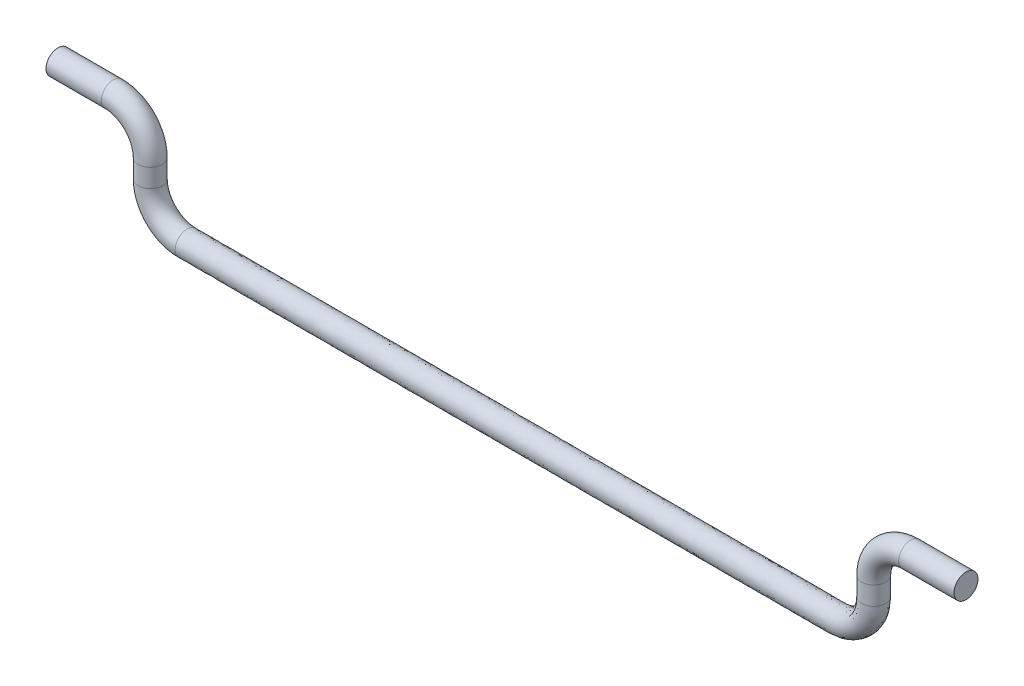
ISO-10303-21;
HEADER;
FILE_DESCRIPTION(('STEP AP214'),'2;1');
FILE_NAME('part.step','',(''),(''),'','','');
FILE_SCHEMA(('AUTOMOTIVE_DESIGN { 1 0 10303 214 1 1 1 1 }'));
ENDSEC;
DATA;
#1=APPLICATION_CONTEXT('core data for automotive mechanical design processes');
#2=APPLICATION_PROTOCOL_DEFINITION('international standard','automotive_design',2000,#1);
#3=PRODUCT_CONTEXT('',#1,'mechanical');
#4=PRODUCT('Part','Part','',(#3));
#5=PRODUCT_RELATED_PRODUCT_CATEGORY('part','',(#4));
#6=PRODUCT_DEFINITION_FORMATION('','',#4);
#7=PRODUCT_DEFINITION_CONTEXT('part definition',#1,'design');
#8=PRODUCT_DEFINITION('design','',#6,#7);
#9=PRODUCT_DEFINITION_SHAPE('','',#8);
#10=(LENGTH_UNIT() NAMED_UNIT(*) SI_UNIT(.MILLI.,.METRE.));
#11=(NAMED_UNIT(*) PLANE_ANGLE_UNIT() SI_UNIT($,.RADIAN.));
#12=(NAMED_UNIT(*) SI_UNIT($,.STERADIAN.) SOLID_ANGLE_UNIT());
#13=UNCERTAINTY_MEASURE_WITH_UNIT(LENGTH_MEASURE(1.E-05),#10,'distance_accuracy_value','');
#14=(GEOMETRIC_REPRESENTATION_CONTEXT(3) GLOBAL_UNCERTAINTY_ASSIGNED_CONTEXT((#13)) GLOBAL_UNIT_ASSIGNED_CONTEXT((#10,
#11,#12)) REPRESENTATION_CONTEXT('',''));
#15=CARTESIAN_POINT('',(0.,0.,0.));
#16=DIRECTION('',(0.,0.,1.));
#17=DIRECTION('',(1.,0.,0.));
#18=AXIS2_PLACEMENT_3D('',#15,#16,#17);
#19=CARTESIAN_POINT('',(42.2,5.,0.));
#20=DIRECTION('',(1.,0.,0.));
#21=DIRECTION('',(0.,0.,-1.));
#22=AXIS2_PLACEMENT_3D('',#19,#20,#21);
#23=PLANE('',#22);
#24=CARTESIAN_POINT('',(42.2,5.,0.));
#25=DIRECTION('',(1.,0.,0.));
#26=DIRECTION('',(0.,0.,-1.));
#27=AXIS2_PLACEMENT_3D('',#24,#25,#26);
#28=CIRCLE('',#27,0.65);
#29=CARTESIAN_POINT('',(42.2,5.,-0.65));
#30=VERTEX_POINT('',#29);
#31=EDGE_CURVE('E78',#30,#30,#28,.T.);
#32=ORIENTED_EDGE('',*,*,#31,.T.);
#33=EDGE_LOOP('',(#32));
#34=FACE_BOUND('',#33,.T.);
#35=ADVANCED_FACE('F39',(#34),#23,.T.);
#36=CARTESIAN_POINT('',(-7.,4.99999999999999,0.));
#37=DIRECTION('',(1.,0.,0.));
#38=DIRECTION('',(0.,0.,-1.));
#39=AXIS2_PLACEMENT_3D('',#36,#37,#38);
#40=PLANE('',#39);
#41=CARTESIAN_POINT('',(-7.,4.99999999999999,0.));
#42=DIRECTION('',(1.,0.,0.));
#43=DIRECTION('',(0.,0.,-1.));
#44=AXIS2_PLACEMENT_3D('',#41,#42,#43);
#45=CIRCLE('',#44,0.65);
#46=CARTESIAN_POINT('',(-7.,4.99999999999999,-0.65));
#47=VERTEX_POINT('',#46);
#48=EDGE_CURVE('E10',#47,#47,#45,.T.);
#49=ORIENTED_EDGE('',*,*,#48,.F.);
#50=EDGE_LOOP('',(#49));
#51=FACE_BOUND('',#50,.T.);
#52=ADVANCED_FACE('F87',(#51),#40,.F.);
#53=CARTESIAN_POINT('',(42.2,5.,0.));
#54=DIRECTION('',(-1.,0.,0.));
#55=DIRECTION('',(0.,0.,1.));
#56=AXIS2_PLACEMENT_3D('',#53,#54,#55);
#57=CYLINDRICAL_SURFACE('',#56,0.65);
#58=CARTESIAN_POINT('',(39.2,5.,0.));
#59=DIRECTION('',(1.,0.,0.));
#60=DIRECTION('',(0.,0.,-1.));
#61=AXIS2_PLACEMENT_3D('',#58,#59,#60);
#62=CIRCLE('',#61,0.65);
#63=CARTESIAN_POINT('',(39.2,5.65,0.));
#64=VERTEX_POINT('',#63);
#65=EDGE_CURVE('E74',#64,#64,#62,.T.);
#66=ORIENTED_EDGE('',*,*,#65,.T.);
#67=EDGE_LOOP('',(#66));
#68=FACE_BOUND('',#67,.T.);
#69=ORIENTED_EDGE('',*,*,#31,.F.);
#70=EDGE_LOOP('',(#69));
#71=FACE_BOUND('',#70,.T.);
#72=ADVANCED_FACE('F84',(#68,#71),#57,.T.);
#73=CARTESIAN_POINT('',(39.2,3.,0.));
#74=DIRECTION('',(0.,0.,1.));
#75=DIRECTION('',(1.,0.,0.));
#76=AXIS2_PLACEMENT_3D('',#73,#74,#75);
#77=TOROIDAL_SURFACE('',#76,2.,0.65);
#78=CARTESIAN_POINT('',(37.2,3.,0.));
#79=DIRECTION('',(0.,1.,0.));
#80=DIRECTION('',(0.,0.,-1.));
#81=AXIS2_PLACEMENT_3D('',#78,#79,#80);
#82=CIRCLE('',#81,0.65);
#83=CARTESIAN_POINT('',(36.55,3.,0.));
#84=VERTEX_POINT('',#83);
#85=EDGE_CURVE('E70',#84,#84,#82,.T.);
#86=CARTESIAN_POINT('',(39.2,3.,0.));
#87=DIRECTION('',(0.,0.,1.));
#88=DIRECTION('',(1.,0.,0.));
#89=AXIS2_PLACEMENT_3D('',#86,#87,#88);
#90=CIRCLE('',#89,2.65);
#91=EDGE_CURVE('',#64,#84,#90,.T.);
#92=ORIENTED_EDGE('',*,*,#65,.F.);
#93=ORIENTED_EDGE('',*,*,#85,.T.);
#94=ORIENTED_EDGE('',*,*,#91,.T.);
#95=ORIENTED_EDGE('',*,*,#91,.F.);
#96=EDGE_LOOP('',(#92,#94,#93,#95));
#97=FACE_BOUND('',#96,.T.);
#98=ADVANCED_FACE('F86',(#97),#77,.T.);
#99=CARTESIAN_POINT('',(37.2,3.,0.));
#100=DIRECTION('',(0.,-1.,0.));
#101=DIRECTION('',(0.,0.,-1.));
#102=AXIS2_PLACEMENT_3D('',#99,#100,#101);
#103=CYLINDRICAL_SURFACE('',#102,0.65);
#104=CARTESIAN_POINT('',(37.2,2.,0.));
#105=DIRECTION('',(0.,1.,0.));
#106=DIRECTION('',(0.,0.,-1.));
#107=AXIS2_PLACEMENT_3D('',#104,#105,#106);
#108=CIRCLE('',#107,0.65);
#109=CARTESIAN_POINT('',(37.2,2.,-0.65));
#110=VERTEX_POINT('',#109);
#111=EDGE_CURVE('E66',#110,#110,#108,.T.);
#112=ORIENTED_EDGE('',*,*,#111,.T.);
#113=EDGE_LOOP('',(#112));
#114=FACE_BOUND('',#113,.T.);
#115=ORIENTED_EDGE('',*,*,#85,.F.);
#116=EDGE_LOOP('',(#115));
#117=FACE_BOUND('',#116,.T.);
#118=ADVANCED_FACE('F94',(#114,#117),#103,.T.);
#119=CARTESIAN_POINT('',(37.2,2.,-0.65));
#120=CARTESIAN_POINT('',(37.2,1.93455015305021,-0.65));
#121=CARTESIAN_POINT('',(37.1967864181831,1.86914747290153,-0.65));
#122=CARTESIAN_POINT('',(37.1839696384264,1.73895813090636,-0.65));
#123=CARTESIAN_POINT('',(37.1743653746865,1.6741721958258,-0.65));
#124=CARTESIAN_POINT('',(37.1360818624047,1.4816211967769,-0.65));
#125=CARTESIAN_POINT('',(37.0978915196712,1.35566358719755,-0.65));
#126=CARTESIAN_POINT('',(36.9474941557254,0.99257223141437,-0.65));
#127=CARTESIAN_POINT('',(36.7993329531879,0.770905828441738,-0.65));
#128=CARTESIAN_POINT('',(36.4290941715583,0.400667046812072,-0.65));
#129=CARTESIAN_POINT('',(36.2074277685884,0.252505844275714,-0.65));
#130=CARTESIAN_POINT('',(35.8443364128011,0.102108480328281,-0.65));
#131=CARTESIAN_POINT('',(35.7183788032222,0.0639181375948269,-0.65));
#132=CARTESIAN_POINT('',(35.5258278041746,0.0256346253137027,-0.65));
#133=CARTESIAN_POINT('',(35.4610418690939,0.0160303615731947,-0.65));
#134=CARTESIAN_POINT('',(35.3308525270982,0.00321358181730516,-0.65));
#135=CARTESIAN_POINT('',(35.2654497176187,8.18116668740894E-06,-0.65));
#136=CARTESIAN_POINT('',(35.1541667572349,-5.72912172166352E-06,-0.65));
#137=CARTESIAN_POINT('',(35.1083333333332,0.,-0.65));
#138=CARTESIAN_POINT('',(35.0166666666668,0.,-0.65));
#139=CARTESIAN_POINT('',(34.9708333333332,0.,-0.65));
#140=CARTESIAN_POINT('',(34.8333333333336,0.,-0.65));
#141=CARTESIAN_POINT('',(34.7416666666664,0.,-0.65));
#142=CARTESIAN_POINT('',(34.4666666666671,0.,-0.65));
#143=CARTESIAN_POINT('',(34.2833333333341,0.,-0.65));
#144=CARTESIAN_POINT('',(33.7333333333317,0.,-0.65));
#145=CARTESIAN_POINT('',(33.366666666667,0.,-0.65));
#146=CARTESIAN_POINT('',(32.266666666666,0.,-0.65));
#147=CARTESIAN_POINT('',(31.5333333333366,0.,-0.65));
#148=CARTESIAN_POINT('',(29.3333333333269,0.,-0.65));
#149=CARTESIAN_POINT('',(27.8666666666629,0.,-0.65));
#150=CARTESIAN_POINT('',(23.4666666666742,0.,-0.65));
#151=CARTESIAN_POINT('',(20.5333333333304,0.,-0.65));
#152=CARTESIAN_POINT('',(14.6666666666696,0.,-0.65));
#153=CARTESIAN_POINT('',(11.7333333333349,0.,-0.65));
#154=CARTESIAN_POINT('',(7.33333333333254,0.,-0.65));
#155=CARTESIAN_POINT('',(5.86666666666745,0.,-0.65));
#156=CARTESIAN_POINT('',(3.66666666666627,0.,-0.65));
#157=CARTESIAN_POINT('',(2.93333333333375,0.,-0.65));
#158=CARTESIAN_POINT('',(1.83333333333316,0.,-0.65));
#159=CARTESIAN_POINT('',(1.46666666666688,0.,-0.65));
#160=CARTESIAN_POINT('',(0.916666666666586,0.,-0.65));
#161=CARTESIAN_POINT('',(0.733333333333413,0.,-0.65));
#162=CARTESIAN_POINT('',(0.458333333333264,0.,-0.65));
#163=CARTESIAN_POINT('',(0.366666666666707,0.,-0.65));
#164=CARTESIAN_POINT('',(0.229166666666633,0.,-0.65));
#165=CARTESIAN_POINT('',(0.183333333333377,0.,-0.65));
#166=CARTESIAN_POINT('',(0.0916666666666621,0.,-0.65));
#167=CARTESIAN_POINT('',(0.045833333333333,0.,-0.65));
#168=CARTESIAN_POINT('',(0.,0.,-0.65));
#169=CARTESIAN_POINT('',(35.9,2.,-0.65));
#170=CARTESIAN_POINT('',(35.9,1.9558213533089,-0.65));
#171=CARTESIAN_POINT('',(35.8988752463644,1.95420161551564,-0.65));
#172=CARTESIAN_POINT('',(35.8943893734489,1.90863534581712,-0.65));
#173=CARTESIAN_POINT('',(35.8910278811404,1.88596026853898,-0.65));
#174=CARTESIAN_POINT('',(35.8776286518413,1.81856741887203,-0.65));
#175=CARTESIAN_POINT('',(35.8642620318848,1.77448225551896,-0.65));
#176=CARTESIAN_POINT('',(35.8116229545042,1.6474002809954,-0.65));
#177=CARTESIAN_POINT('',(35.7597665336162,1.56981703995506,-0.65));
#178=CARTESIAN_POINT('',(35.6301829600449,1.44023346638377,-0.65));
#179=CARTESIAN_POINT('',(35.5525997190055,1.38837704549651,-0.65));
#180=CARTESIAN_POINT('',(35.4255177444806,1.33573796811489,-0.65));
#181=CARTESIAN_POINT('',(35.3814325811275,1.32237134815815,-0.65));
#182=CARTESIAN_POINT('',(35.3140397314612,1.30897211885981,-0.65));
#183=CARTESIAN_POINT('',(35.2913646541829,1.30561062655062,-0.65));
#184=CARTESIAN_POINT('',(35.2457983844844,1.30112475363606,-0.65));
#185=CARTESIAN_POINT('',(35.2441786014252,1.30000286340833,-0.65));
#186=CARTESIAN_POINT('',(35.1690625316989,1.29999799480741,-0.65));
#187=CARTESIAN_POINT('',(35.1083333333332,1.3,-0.65));
#188=CARTESIAN_POINT('',(35.0166666666668,1.3,-0.65));
#189=CARTESIAN_POINT('',(34.9708333333332,1.3,-0.65));
#190=CARTESIAN_POINT('',(34.8333333333336,1.3,-0.65));
#191=CARTESIAN_POINT('',(34.7416666666664,1.3,-0.65));
#192=CARTESIAN_POINT('',(34.4666666666671,1.3,-0.65));
#193=CARTESIAN_POINT('',(34.2833333333341,1.3,-0.65));
#194=CARTESIAN_POINT('',(33.7333333333317,1.3,-0.65));
#195=CARTESIAN_POINT('',(33.366666666667,1.3,-0.65));
#196=CARTESIAN_POINT('',(32.266666666666,1.3,-0.65));
#197=CARTESIAN_POINT('',(31.5333333333366,1.3,-0.65));
#198=CARTESIAN_POINT('',(29.3333333333269,1.3,-0.65));
#199=CARTESIAN_POINT('',(27.8666666666629,1.3,-0.65));
#200=CARTESIAN_POINT('',(23.4666666666742,1.3,-0.65));
#201=CARTESIAN_POINT('',(20.5333333333304,1.3,-0.65));
#202=CARTESIAN_POINT('',(14.6666666666696,1.3,-0.65));
#203=CARTESIAN_POINT('',(11.7333333333349,1.3,-0.65));
#204=CARTESIAN_POINT('',(7.33333333333254,1.3,-0.65));
#205=CARTESIAN_POINT('',(5.86666666666745,1.3,-0.65));
#206=CARTESIAN_POINT('',(3.66666666666627,1.3,-0.65));
#207=CARTESIAN_POINT('',(2.93333333333375,1.3,-0.65));
#208=CARTESIAN_POINT('',(1.83333333333316,1.3,-0.65));
#209=CARTESIAN_POINT('',(1.46666666666688,1.3,-0.65));
#210=CARTESIAN_POINT('',(0.916666666666586,1.3,-0.65));
#211=CARTESIAN_POINT('',(0.733333333333413,1.3,-0.65));
#212=CARTESIAN_POINT('',(0.458333333333264,1.3,-0.65));
#213=CARTESIAN_POINT('',(0.366666666666707,1.3,-0.65));
#214=CARTESIAN_POINT('',(0.229166666666633,1.3,-0.65));
#215=CARTESIAN_POINT('',(0.183333333333377,1.3,-0.65));
#216=CARTESIAN_POINT('',(0.0916666666666621,1.3,-0.65));
#217=CARTESIAN_POINT('',(0.0309374999999998,1.29999999999999,-0.65));
#218=CARTESIAN_POINT('',(0.,1.29999999999999,-0.65));
#219=CARTESIAN_POINT('',(35.9,2.,0.65));
#220=CARTESIAN_POINT('',(35.9,1.9558213533089,0.65));
#221=CARTESIAN_POINT('',(35.8988752463644,1.95420161551564,0.65));
#222=CARTESIAN_POINT('',(35.8943893734489,1.90863534581712,0.65));
#223=CARTESIAN_POINT('',(35.8910278811404,1.88596026853898,0.65));
#224=CARTESIAN_POINT('',(35.8776286518413,1.81856741887203,0.65));
#225=CARTESIAN_POINT('',(35.8642620318848,1.77448225551896,0.65));
#226=CARTESIAN_POINT('',(35.8116229545042,1.6474002809954,0.65));
#227=CARTESIAN_POINT('',(35.7597665336162,1.56981703995506,0.65));
#228=CARTESIAN_POINT('',(35.6301829600449,1.44023346638377,0.65));
#229=CARTESIAN_POINT('',(35.5525997190055,1.38837704549651,0.65));
#230=CARTESIAN_POINT('',(35.4255177444806,1.33573796811489,0.65));
#231=CARTESIAN_POINT('',(35.3814325811275,1.32237134815815,0.65));
#232=CARTESIAN_POINT('',(35.3140397314612,1.30897211885981,0.65));
#233=CARTESIAN_POINT('',(35.2913646541829,1.30561062655062,0.65));
#234=CARTESIAN_POINT('',(35.2457983844844,1.30112475363606,0.65));
#235=CARTESIAN_POINT('',(35.2441786014252,1.30000286340833,0.65));
#236=CARTESIAN_POINT('',(35.1690625316989,1.29999799480741,0.65));
#237=CARTESIAN_POINT('',(35.1083333333332,1.3,0.65));
#238=CARTESIAN_POINT('',(35.0166666666668,1.3,0.65));
#239=CARTESIAN_POINT('',(34.9708333333332,1.3,0.65));
#240=CARTESIAN_POINT('',(34.8333333333336,1.3,0.65));
#241=CARTESIAN_POINT('',(34.7416666666664,1.3,0.65));
#242=CARTESIAN_POINT('',(34.4666666666671,1.3,0.65));
#243=CARTESIAN_POINT('',(34.2833333333341,1.3,0.65));
#244=CARTESIAN_POINT('',(33.7333333333317,1.3,0.65));
#245=CARTESIAN_POINT('',(33.366666666667,1.3,0.65));
#246=CARTESIAN_POINT('',(32.266666666666,1.3,0.65));
#247=CARTESIAN_POINT('',(31.5333333333366,1.3,0.65));
#248=CARTESIAN_POINT('',(29.3333333333269,1.3,0.65));
#249=CARTESIAN_POINT('',(27.8666666666629,1.3,0.65));
#250=CARTESIAN_POINT('',(23.4666666666742,1.3,0.65));
#251=CARTESIAN_POINT('',(20.5333333333304,1.3,0.65));
#252=CARTESIAN_POINT('',(14.6666666666696,1.3,0.65));
#253=CARTESIAN_POINT('',(11.7333333333349,1.3,0.65));
#254=CARTESIAN_POINT('',(7.33333333333254,1.3,0.65));
#255=CARTESIAN_POINT('',(5.86666666666745,1.3,0.65));
#256=CARTESIAN_POINT('',(3.66666666666627,1.3,0.65));
#257=CARTESIAN_POINT('',(2.93333333333375,1.3,0.65));
#258=CARTESIAN_POINT('',(1.83333333333316,1.3,0.65));
#259=CARTESIAN_POINT('',(1.46666666666688,1.3,0.65));
#260=CARTESIAN_POINT('',(0.916666666666586,1.3,0.65));
#261=CARTESIAN_POINT('',(0.733333333333413,1.3,0.65));
#262=CARTESIAN_POINT('',(0.458333333333264,1.3,0.65));
#263=CARTESIAN_POINT('',(0.366666666666707,1.3,0.65));
#264=CARTESIAN_POINT('',(0.229166666666633,1.3,0.65));
#265=CARTESIAN_POINT('',(0.183333333333377,1.3,0.65));
#266=CARTESIAN_POINT('',(0.0916666666666621,1.3,0.65));
#267=CARTESIAN_POINT('',(0.0309374999999998,1.29999999999999,0.65));
#268=CARTESIAN_POINT('',(0.,1.29999999999999,0.65));
#269=CARTESIAN_POINT('',(37.2,2.,0.65));
#270=CARTESIAN_POINT('',(37.2,1.93455015305021,0.65));
#271=CARTESIAN_POINT('',(37.1967864181831,1.86914747290153,0.65));
#272=CARTESIAN_POINT('',(37.1839696384264,1.73895813090636,0.65));
#273=CARTESIAN_POINT('',(37.1743653746865,1.6741721958258,0.65));
#274=CARTESIAN_POINT('',(37.1360818624047,1.4816211967769,0.65));
#275=CARTESIAN_POINT('',(37.0978915196712,1.35566358719755,0.65));
#276=CARTESIAN_POINT('',(36.9474941557254,0.99257223141437,0.65));
#277=CARTESIAN_POINT('',(36.7993329531879,0.770905828441738,0.65));
#278=CARTESIAN_POINT('',(36.4290941715583,0.400667046812072,0.65));
#279=CARTESIAN_POINT('',(36.2074277685884,0.252505844275714,0.65));
#280=CARTESIAN_POINT('',(35.8443364128011,0.102108480328281,0.65));
#281=CARTESIAN_POINT('',(35.7183788032222,0.0639181375948269,0.65));
#282=CARTESIAN_POINT('',(35.5258278041746,0.0256346253137027,0.65));
#283=CARTESIAN_POINT('',(35.4610418690939,0.0160303615731947,0.65));
#284=CARTESIAN_POINT('',(35.3308525270982,0.00321358181730516,0.65));
#285=CARTESIAN_POINT('',(35.2654497176187,8.18116668743372E-06,0.65));
#286=CARTESIAN_POINT('',(35.1541667572349,-5.72912172154553E-06,0.65));
#287=CARTESIAN_POINT('',(35.1083333333332,0.,0.65));
#288=CARTESIAN_POINT('',(35.0166666666668,0.,0.65));
#289=CARTESIAN_POINT('',(34.9708333333332,0.,0.65));
#290=CARTESIAN_POINT('',(34.8333333333336,0.,0.65));
#291=CARTESIAN_POINT('',(34.7416666666664,0.,0.65));
#292=CARTESIAN_POINT('',(34.4666666666671,0.,0.65));
#293=CARTESIAN_POINT('',(34.2833333333341,0.,0.65));
#294=CARTESIAN_POINT('',(33.7333333333317,0.,0.65));
#295=CARTESIAN_POINT('',(33.366666666667,0.,0.65));
#296=CARTESIAN_POINT('',(32.266666666666,0.,0.65));
#297=CARTESIAN_POINT('',(31.5333333333366,0.,0.65));
#298=CARTESIAN_POINT('',(29.3333333333269,0.,0.65));
#299=CARTESIAN_POINT('',(27.8666666666629,0.,0.65));
#300=CARTESIAN_POINT('',(23.4666666666742,0.,0.65));
#301=CARTESIAN_POINT('',(20.5333333333304,0.,0.65));
#302=CARTESIAN_POINT('',(14.6666666666696,0.,0.65));
#303=CARTESIAN_POINT('',(11.7333333333349,0.,0.65));
#304=CARTESIAN_POINT('',(7.33333333333254,0.,0.65));
#305=CARTESIAN_POINT('',(5.86666666666745,0.,0.65));
#306=CARTESIAN_POINT('',(3.66666666666627,0.,0.65));
#307=CARTESIAN_POINT('',(2.93333333333375,0.,0.65));
#308=CARTESIAN_POINT('',(1.83333333333316,0.,0.65));
#309=CARTESIAN_POINT('',(1.46666666666688,0.,0.65));
#310=CARTESIAN_POINT('',(0.916666666666586,0.,0.65));
#311=CARTESIAN_POINT('',(0.733333333333413,0.,0.65));
#312=CARTESIAN_POINT('',(0.458333333333264,0.,0.65));
#313=CARTESIAN_POINT('',(0.366666666666707,0.,0.65));
#314=CARTESIAN_POINT('',(0.229166666666633,0.,0.65));
#315=CARTESIAN_POINT('',(0.183333333333377,0.,0.65));
#316=CARTESIAN_POINT('',(0.0916666666666621,0.,0.65));
#317=CARTESIAN_POINT('',(0.045833333333333,0.,0.65));
#318=CARTESIAN_POINT('',(0.,0.,0.65));
#319=CARTESIAN_POINT('',(38.5,2.,0.65));
#320=CARTESIAN_POINT('',(38.5,1.91327895279153,0.65));
#321=CARTESIAN_POINT('',(38.4946975900017,1.78409333028743,0.65));
#322=CARTESIAN_POINT('',(38.4735499034039,1.5692809159956,0.65));
#323=CARTESIAN_POINT('',(38.4577028682326,1.46238412311262,0.65));
#324=CARTESIAN_POINT('',(38.3945350729681,1.14467497468176,0.65));
#325=CARTESIAN_POINT('',(38.3315210074575,0.936844918876133,0.65));
#326=CARTESIAN_POINT('',(38.0833653569467,0.337744181833343,0.65));
#327=CARTESIAN_POINT('',(37.8388993727596,-0.0280053830715863,0.65));
#328=CARTESIAN_POINT('',(37.2280053830716,-0.638899372759627,0.65));
#329=CARTESIAN_POINT('',(36.8622558181712,-0.883365356945083,0.65));
#330=CARTESIAN_POINT('',(36.2631550811216,-1.13152100745833,0.65));
#331=CARTESIAN_POINT('',(36.0553250253168,-1.1945350729685,0.65));
#332=CARTESIAN_POINT('',(35.737615876888,-1.25770286823241,0.65));
#333=CARTESIAN_POINT('',(35.6307190840049,-1.27354990340423,0.65));
#334=CARTESIAN_POINT('',(35.4159066697121,-1.29469759000144,0.65));
#335=CARTESIAN_POINT('',(35.2867208338122,-1.29998650107495,0.65));
#336=CARTESIAN_POINT('',(35.1392709827708,-1.30000945305085,0.65));
#337=CARTESIAN_POINT('',(35.1083333333332,-1.3,0.65));
#338=CARTESIAN_POINT('',(35.0166666666668,-1.3,0.65));
#339=CARTESIAN_POINT('',(34.9708333333332,-1.3,0.65));
#340=CARTESIAN_POINT('',(34.8333333333336,-1.3,0.65));
#341=CARTESIAN_POINT('',(34.7416666666664,-1.3,0.65));
#342=CARTESIAN_POINT('',(34.4666666666671,-1.3,0.65));
#343=CARTESIAN_POINT('',(34.2833333333341,-1.3,0.65));
#344=CARTESIAN_POINT('',(33.7333333333317,-1.3,0.65));
#345=CARTESIAN_POINT('',(33.366666666667,-1.3,0.65));
#346=CARTESIAN_POINT('',(32.266666666666,-1.3,0.65));
#347=CARTESIAN_POINT('',(31.5333333333366,-1.3,0.65));
#348=CARTESIAN_POINT('',(29.3333333333269,-1.3,0.65));
#349=CARTESIAN_POINT('',(27.8666666666629,-1.3,0.65));
#350=CARTESIAN_POINT('',(23.4666666666742,-1.3,0.65));
#351=CARTESIAN_POINT('',(20.5333333333304,-1.3,0.65));
#352=CARTESIAN_POINT('',(14.6666666666696,-1.3,0.65));
#353=CARTESIAN_POINT('',(11.7333333333349,-1.3,0.65));
#354=CARTESIAN_POINT('',(7.33333333333254,-1.3,0.65));
#355=CARTESIAN_POINT('',(5.86666666666745,-1.3,0.65));
#356=CARTESIAN_POINT('',(3.66666666666627,-1.3,0.65));
#357=CARTESIAN_POINT('',(2.93333333333375,-1.3,0.65));
#358=CARTESIAN_POINT('',(1.83333333333316,-1.3,0.65));
#359=CARTESIAN_POINT('',(1.46666666666688,-1.3,0.65));
#360=CARTESIAN_POINT('',(0.916666666666586,-1.3,0.65));
#361=CARTESIAN_POINT('',(0.733333333333413,-1.3,0.65));
#362=CARTESIAN_POINT('',(0.458333333333264,-1.3,0.65));
#363=CARTESIAN_POINT('',(0.366666666666707,-1.3,0.65));
#364=CARTESIAN_POINT('',(0.229166666666633,-1.3,0.65));
#365=CARTESIAN_POINT('',(0.183333333333377,-1.3,0.65));
#366=CARTESIAN_POINT('',(0.0916666666666621,-1.3,0.65));
#367=CARTESIAN_POINT('',(0.0607291666666662,-1.30000000000001,0.65));
#368=CARTESIAN_POINT('',(0.,-1.30000000000001,0.65));
#369=CARTESIAN_POINT('',(38.5,2.,-0.65));
#370=CARTESIAN_POINT('',(38.5,1.91327895279153,-0.65));
#371=CARTESIAN_POINT('',(38.4946975900017,1.78409333028743,-0.65));
#372=CARTESIAN_POINT('',(38.4735499034039,1.5692809159956,-0.65));
#373=CARTESIAN_POINT('',(38.4577028682326,1.46238412311262,-0.65));
#374=CARTESIAN_POINT('',(38.3945350729681,1.14467497468176,-0.65));
#375=CARTESIAN_POINT('',(38.3315210074575,0.936844918876133,-0.65));
#376=CARTESIAN_POINT('',(38.0833653569467,0.337744181833343,-0.65));
#377=CARTESIAN_POINT('',(37.8388993727596,-0.0280053830715863,-0.65));
#378=CARTESIAN_POINT('',(37.2280053830716,-0.638899372759627,-0.65));
#379=CARTESIAN_POINT('',(36.8622558181712,-0.883365356945083,-0.65));
#380=CARTESIAN_POINT('',(36.2631550811216,-1.13152100745833,-0.65));
#381=CARTESIAN_POINT('',(36.0553250253168,-1.1945350729685,-0.65));
#382=CARTESIAN_POINT('',(35.737615876888,-1.25770286823241,-0.65));
#383=CARTESIAN_POINT('',(35.6307190840049,-1.27354990340423,-0.65));
#384=CARTESIAN_POINT('',(35.4159066697121,-1.29469759000144,-0.65));
#385=CARTESIAN_POINT('',(35.2867208338122,-1.29998650107495,-0.65));
#386=CARTESIAN_POINT('',(35.1392709827708,-1.30000945305085,-0.65));
#387=CARTESIAN_POINT('',(35.1083333333332,-1.3,-0.65));
#388=CARTESIAN_POINT('',(35.0166666666668,-1.3,-0.65));
#389=CARTESIAN_POINT('',(34.9708333333332,-1.3,-0.65));
#390=CARTESIAN_POINT('',(34.8333333333336,-1.3,-0.65));
#391=CARTESIAN_POINT('',(34.7416666666664,-1.3,-0.65));
#392=CARTESIAN_POINT('',(34.4666666666671,-1.3,-0.65));
#393=CARTESIAN_POINT('',(34.2833333333341,-1.3,-0.65));
#394=CARTESIAN_POINT('',(33.7333333333317,-1.3,-0.65));
#395=CARTESIAN_POINT('',(33.366666666667,-1.3,-0.65));
#396=CARTESIAN_POINT('',(32.266666666666,-1.3,-0.65));
#397=CARTESIAN_POINT('',(31.5333333333366,-1.3,-0.65));
#398=CARTESIAN_POINT('',(29.3333333333269,-1.3,-0.65));
#399=CARTESIAN_POINT('',(27.8666666666629,-1.3,-0.65));
#400=CARTESIAN_POINT('',(23.4666666666742,-1.3,-0.65));
#401=CARTESIAN_POINT('',(20.5333333333304,-1.3,-0.65));
#402=CARTESIAN_POINT('',(14.6666666666696,-1.3,-0.65));
#403=CARTESIAN_POINT('',(11.7333333333349,-1.3,-0.65));
#404=CARTESIAN_POINT('',(7.33333333333254,-1.3,-0.65));
#405=CARTESIAN_POINT('',(5.86666666666745,-1.3,-0.65));
#406=CARTESIAN_POINT('',(3.66666666666627,-1.3,-0.65));
#407=CARTESIAN_POINT('',(2.93333333333375,-1.3,-0.65));
#408=CARTESIAN_POINT('',(1.83333333333316,-1.3,-0.65));
#409=CARTESIAN_POINT('',(1.46666666666688,-1.3,-0.65));
#410=CARTESIAN_POINT('',(0.916666666666586,-1.3,-0.65));
#411=CARTESIAN_POINT('',(0.733333333333413,-1.3,-0.65));
#412=CARTESIAN_POINT('',(0.458333333333264,-1.3,-0.65));
#413=CARTESIAN_POINT('',(0.366666666666707,-1.3,-0.65));
#414=CARTESIAN_POINT('',(0.229166666666633,-1.3,-0.65));
#415=CARTESIAN_POINT('',(0.183333333333377,-1.3,-0.65));
#416=CARTESIAN_POINT('',(0.0916666666666621,-1.3,-0.65));
#417=CARTESIAN_POINT('',(0.0607291666666662,-1.30000000000001,-0.65));
#418=CARTESIAN_POINT('',(0.,-1.30000000000001,-0.65));
#419=CARTESIAN_POINT('',(37.2,2.,-0.65));
#420=CARTESIAN_POINT('',(37.2,1.93455015305021,-0.65));
#421=CARTESIAN_POINT('',(37.1967864181831,1.86914747290153,-0.65));
#422=CARTESIAN_POINT('',(37.1839696384264,1.73895813090636,-0.65));
#423=CARTESIAN_POINT('',(37.1743653746865,1.6741721958258,-0.65));
#424=CARTESIAN_POINT('',(37.1360818624047,1.4816211967769,-0.65));
#425=CARTESIAN_POINT('',(37.0978915196712,1.35566358719755,-0.65));
#426=CARTESIAN_POINT('',(36.9474941557254,0.99257223141437,-0.65));
#427=CARTESIAN_POINT('',(36.7993329531879,0.770905828441738,-0.65));
#428=CARTESIAN_POINT('',(36.4290941715583,0.400667046812072,-0.65));
#429=CARTESIAN_POINT('',(36.2074277685884,0.252505844275714,-0.65));
#430=CARTESIAN_POINT('',(35.8443364128011,0.102108480328281,-0.65));
#431=CARTESIAN_POINT('',(35.7183788032222,0.0639181375948269,-0.65));
#432=CARTESIAN_POINT('',(35.5258278041746,0.0256346253137027,-0.65));
#433=CARTESIAN_POINT('',(35.4610418690939,0.0160303615731947,-0.65));
#434=CARTESIAN_POINT('',(35.3308525270982,0.00321358181730516,-0.65));
#435=CARTESIAN_POINT('',(35.2654497176187,8.18116668740894E-06,-0.65));
#436=CARTESIAN_POINT('',(35.1541667572349,-5.72912172166352E-06,-0.65));
#437=CARTESIAN_POINT('',(35.1083333333332,0.,-0.65));
#438=CARTESIAN_POINT('',(35.0166666666668,0.,-0.65));
#439=CARTESIAN_POINT('',(34.9708333333332,0.,-0.65));
#440=CARTESIAN_POINT('',(34.8333333333336,0.,-0.65));
#441=CARTESIAN_POINT('',(34.7416666666664,0.,-0.65));
#442=CARTESIAN_POINT('',(34.4666666666671,0.,-0.65));
#443=CARTESIAN_POINT('',(34.2833333333341,0.,-0.65));
#444=CARTESIAN_POINT('',(33.7333333333317,0.,-0.65));
#445=CARTESIAN_POINT('',(33.366666666667,0.,-0.65));
#446=CARTESIAN_POINT('',(32.266666666666,0.,-0.65));
#447=CARTESIAN_POINT('',(31.5333333333366,0.,-0.65));
#448=CARTESIAN_POINT('',(29.3333333333269,0.,-0.65));
#449=CARTESIAN_POINT('',(27.8666666666629,0.,-0.65));
#450=CARTESIAN_POINT('',(23.4666666666742,0.,-0.65));
#451=CARTESIAN_POINT('',(20.5333333333304,0.,-0.65));
#452=CARTESIAN_POINT('',(14.6666666666696,0.,-0.65));
#453=CARTESIAN_POINT('',(11.7333333333349,0.,-0.65));
#454=CARTESIAN_POINT('',(7.33333333333254,0.,-0.65));
#455=CARTESIAN_POINT('',(5.86666666666745,0.,-0.65));
#456=CARTESIAN_POINT('',(3.66666666666627,0.,-0.65));
#457=CARTESIAN_POINT('',(2.93333333333375,0.,-0.65));
#458=CARTESIAN_POINT('',(1.83333333333316,0.,-0.65));
#459=CARTESIAN_POINT('',(1.46666666666688,0.,-0.65));
#460=CARTESIAN_POINT('',(0.916666666666586,0.,-0.65));
#461=CARTESIAN_POINT('',(0.733333333333413,0.,-0.65));
#462=CARTESIAN_POINT('',(0.458333333333264,0.,-0.65));
#463=CARTESIAN_POINT('',(0.366666666666707,0.,-0.65));
#464=CARTESIAN_POINT('',(0.229166666666633,0.,-0.65));
#465=CARTESIAN_POINT('',(0.183333333333377,0.,-0.65));
#466=CARTESIAN_POINT('',(0.0916666666666621,0.,-0.65));
#467=CARTESIAN_POINT('',(0.045833333333333,0.,-0.65));
#468=CARTESIAN_POINT('',(0.,0.,-0.65));
#469=(BOUNDED_SURFACE() B_SPLINE_SURFACE(3,3,((#119,#120,#121,#122,#123,#124,#125,#126,#127,
#128,#129,#130,#131,#132,#133,#134,#135,#136,#137,#138,#139,#140,#141,#142,#143,#144,#145,#146,
#147,#148,#149,#150,#151,#152,#153,#154,#155,#156,#157,#158,#159,#160,#161,#162,#163,#164,#165,
#166,#167,#168),(#169,#170,#171,#172,#173,#174,#175,#176,#177,#178,#179,#180,#181,#182,#183,
#184,#185,#186,#187,#188,#189,#190,#191,#192,#193,#194,#195,#196,#197,#198,#199,#200,#201,#202,
#203,#204,#205,#206,#207,#208,#209,#210,#211,#212,#213,#214,#215,#216,#217,#218),(#219,#220,
#221,#222,#223,#224,#225,#226,#227,#228,#229,#230,#231,#232,#233,#234,#235,#236,#237,#238,#239,
#240,#241,#242,#243,#244,#245,#246,#247,#248,#249,#250,#251,#252,#253,#254,#255,#256,#257,#258,
#259,#260,#261,#262,#263,#264,#265,#266,#267,#268),(#269,#270,#271,#272,#273,#274,#275,#276,
#277,#278,#279,#280,#281,#282,#283,#284,#285,#286,#287,#288,#289,#290,#291,#292,#293,#294,#295,
#296,#297,#298,#299,#300,#301,#302,#303,#304,#305,#306,#307,#308,#309,#310,#311,#312,#313,#314,
#315,#316,#317,#318),(#319,#320,#321,#322,#323,#324,#325,#326,#327,#328,#329,#330,#331,#332,
#333,#334,#335,#336,#337,#338,#339,#340,#341,#342,#343,#344,#345,#346,#347,#348,#349,#350,#351,
#352,#353,#354,#355,#356,#357,#358,#359,#360,#361,#362,#363,#364,#365,#366,#367,#368),(#369,
#370,#371,#372,#373,#374,#375,#376,#377,#378,#379,#380,#381,#382,#383,#384,#385,#386,#387,#388,
#389,#390,#391,#392,#393,#394,#395,#396,#397,#398,#399,#400,#401,#402,#403,#404,#405,#406,#407,
#408,#409,#410,#411,#412,#413,#414,#415,#416,#417,#418),(#419,#420,#421,#422,#423,#424,#425,
#426,#427,#428,#429,#430,#431,#432,#433,#434,#435,#436,#437,#438,#439,#440,#441,#442,#443,#444,
#445,#446,#447,#448,#449,#450,#451,#452,#453,#454,#455,#456,#457,#458,#459,#460,#461,#462,#463,
#464,#465,#466,#467,#468)),.UNSPECIFIED.,.T.,.F.,.F.) B_SPLINE_SURFACE_WITH_KNOTS((4,3,4),(4,2,
2,2,2,2,2,2,2,2,2,2,2,2,2,2,2,2,2,2,2,2,2,2,4),(0.,0.5,1.),(0.128062711898108,0.131583642858582,
0.135104573819056,0.142146435740004,0.1562301595819,0.170313883423795,0.177355745344743,
0.180876676305217,0.184397607265691,0.186863250958928,0.189328894652165,0.194260182038638,
0.204122756811585,0.22384790635748,0.263298205449268,0.342198803632846,0.5,0.657801196367154,
0.736701794550732,0.77615209364252,0.795877243188414,0.805739817961362,0.810671105347835,
0.813136749041072,0.815602392734309),
.UNSPECIFIED.) GEOMETRIC_REPRESENTATION_ITEM() RATIONAL_B_SPLINE_SURFACE(((1.,1.,1.,1.,1.,1.,1.,
1.,1.,1.,1.,1.,1.,1.,1.,1.,1.,1.,1.,1.,1.,1.,1.,1.,1.,1.,1.,1.,1.,1.,1.,1.,1.,1.,1.,1.,1.,1.,1.,
1.,1.,1.,1.,1.,1.,1.,1.,1.,1.,1.),(0.333333333333333,0.333333333333333,0.333333333333333,
0.333333333333333,0.333333333333333,0.333333333333333,0.333333333333333,0.333333333333333,
0.333333333333333,0.333333333333333,0.333333333333333,0.333333333333333,0.333333333333333,
0.333333333333333,0.333333333333333,0.333333333333333,0.333333333333333,0.333333333333333,
0.333333333333333,0.333333333333333,0.333333333333333,0.333333333333333,0.333333333333333,
0.333333333333333,0.333333333333333,0.333333333333333,0.333333333333333,0.333333333333333,
0.333333333333333,0.333333333333333,0.333333333333333,0.333333333333333,0.333333333333333,
0.333333333333333,0.333333333333333,0.333333333333333,0.333333333333333,0.333333333333333,
0.333333333333333,0.333333333333333,0.333333333333333,0.333333333333333,0.333333333333333,
0.333333333333333,0.333333333333333,0.333333333333333,0.333333333333333,0.333333333333333,
0.333333333333333,0.333333333333333),(0.333333333333333,0.333333333333333,0.333333333333333,
0.333333333333333,0.333333333333333,0.333333333333333,0.333333333333333,0.333333333333333,
0.333333333333333,0.333333333333333,0.333333333333333,0.333333333333333,0.333333333333333,
0.333333333333333,0.333333333333333,0.333333333333333,0.333333333333333,0.333333333333333,
0.333333333333333,0.333333333333333,0.333333333333333,0.333333333333333,0.333333333333333,
0.333333333333333,0.333333333333333,0.333333333333333,0.333333333333333,0.333333333333333,
0.333333333333333,0.333333333333333,0.333333333333333,0.333333333333333,0.333333333333333,
0.333333333333333,0.333333333333333,0.333333333333333,0.333333333333333,0.333333333333333,
0.333333333333333,0.333333333333333,0.333333333333333,0.333333333333333,0.333333333333333,
0.333333333333333,0.333333333333333,0.333333333333333,0.333333333333333,0.333333333333333,
0.333333333333333,0.333333333333333),(1.,1.,1.,1.,1.,1.,1.,1.,1.,1.,1.,1.,1.,1.,1.,1.,1.,1.,1.,
1.,1.,1.,1.,1.,1.,1.,1.,1.,1.,1.,1.,1.,1.,1.,1.,1.,1.,1.,1.,1.,1.,1.,1.,1.,1.,1.,1.,1.,1.,1.),
(0.333333333333333,0.333333333333333,0.333333333333333,0.333333333333333,0.333333333333333,
0.333333333333333,0.333333333333333,0.333333333333333,0.333333333333333,0.333333333333333,
0.333333333333333,0.333333333333333,0.333333333333333,0.333333333333333,0.333333333333333,
0.333333333333333,0.333333333333333,0.333333333333333,0.333333333333333,0.333333333333333,
0.333333333333333,0.333333333333333,0.333333333333333,0.333333333333333,0.333333333333333,
0.333333333333333,0.333333333333333,0.333333333333333,0.333333333333333,0.333333333333333,
0.333333333333333,0.333333333333333,0.333333333333333,0.333333333333333,0.333333333333333,
0.333333333333333,0.333333333333333,0.333333333333333,0.333333333333333,0.333333333333333,
0.333333333333333,0.333333333333333,0.333333333333333,0.333333333333333,0.333333333333333,
0.333333333333333,0.333333333333333,0.333333333333333,0.333333333333333,0.333333333333333),
(0.333333333333333,0.333333333333333,0.333333333333333,0.333333333333333,0.333333333333333,
0.333333333333333,0.333333333333333,0.333333333333333,0.333333333333333,0.333333333333333,
0.333333333333333,0.333333333333333,0.333333333333333,0.333333333333333,0.333333333333333,
0.333333333333333,0.333333333333333,0.333333333333333,0.333333333333333,0.333333333333333,
0.333333333333333,0.333333333333333,0.333333333333333,0.333333333333333,0.333333333333333,
0.333333333333333,0.333333333333333,0.333333333333333,0.333333333333333,0.333333333333333,
0.333333333333333,0.333333333333333,0.333333333333333,0.333333333333333,0.333333333333333,
0.333333333333333,0.333333333333333,0.333333333333333,0.333333333333333,0.333333333333333,
0.333333333333333,0.333333333333333,0.333333333333333,0.333333333333333,0.333333333333333,
0.333333333333333,0.333333333333333,0.333333333333333,0.333333333333333,0.333333333333333),(1.,
1.,1.,1.,1.,1.,1.,1.,1.,1.,1.,1.,1.,1.,1.,1.,1.,1.,1.,1.,1.,1.,1.,1.,1.,1.,1.,1.,1.,1.,1.,1.,1.,
1.,1.,1.,1.,1.,1.,1.,1.,1.,1.,1.,1.,1.,1.,1.,1.,1.))) REPRESENTATION_ITEM('') SURFACE());
#470=CARTESIAN_POINT('',(0.,0.,0.));
#471=DIRECTION('',(1.,0.,0.));
#472=DIRECTION('',(0.,0.,-1.));
#473=AXIS2_PLACEMENT_3D('',#470,#471,#472);
#474=CIRCLE('',#473,0.65);
#475=CARTESIAN_POINT('',(0.,-0.650000000000006,0.));
#476=VERTEX_POINT('',#475);
#477=EDGE_CURVE('E62',#476,#476,#474,.T.);
#478=ORIENTED_EDGE('',*,*,#477,.T.);
#479=EDGE_LOOP('',(#478));
#480=FACE_BOUND('',#479,.T.);
#481=ORIENTED_EDGE('',*,*,#111,.F.);
#482=EDGE_LOOP('',(#481));
#483=FACE_BOUND('',#482,.T.);
#484=ADVANCED_FACE('F115',(#480,#483),#469,.F.);
#485=CARTESIAN_POINT('',(0.,2.,0.));
#486=DIRECTION('',(0.,0.,-1.));
#487=DIRECTION('',(-1.,0.,0.));
#488=AXIS2_PLACEMENT_3D('',#485,#486,#487);
#489=TOROIDAL_SURFACE('',#488,2.00000000000001,0.65);
#490=CARTESIAN_POINT('',(-2.,2.,0.));
#491=DIRECTION('',(0.,-1.,0.));
#492=DIRECTION('',(0.,0.,-1.));
#493=AXIS2_PLACEMENT_3D('',#490,#491,#492);
#494=CIRCLE('',#493,0.65);
#495=CARTESIAN_POINT('',(-2.65000000000001,2.,0.));
#496=VERTEX_POINT('',#495);
#497=EDGE_CURVE('E56',#496,#496,#494,.T.);
#498=CARTESIAN_POINT('',(0.,2.,0.));
#499=DIRECTION('',(0.,0.,-1.));
#500=DIRECTION('',(-1.,0.,0.));
#501=AXIS2_PLACEMENT_3D('',#498,#499,#500);
#502=CIRCLE('',#501,2.65000000000001);
#503=EDGE_CURVE('',#476,#496,#502,.T.);
#504=ORIENTED_EDGE('',*,*,#477,.F.);
#505=ORIENTED_EDGE('',*,*,#497,.T.);
#506=ORIENTED_EDGE('',*,*,#503,.T.);
#507=ORIENTED_EDGE('',*,*,#503,.F.);
#508=EDGE_LOOP('',(#504,#506,#505,#507));
#509=FACE_BOUND('',#508,.T.);
#510=ADVANCED_FACE('F111',(#509),#489,.T.);
#511=CARTESIAN_POINT('',(-2.,2.,0.));
#512=DIRECTION('',(0.,1.,0.));
#513=DIRECTION('',(0.,0.,1.));
#514=AXIS2_PLACEMENT_3D('',#511,#512,#513);
#515=CYLINDRICAL_SURFACE('',#514,0.65);
#516=CARTESIAN_POINT('',(-2.,3.,0.));
#517=DIRECTION('',(0.,-1.,0.));
#518=DIRECTION('',(0.,0.,-1.));
#519=AXIS2_PLACEMENT_3D('',#516,#517,#518);
#520=CIRCLE('',#519,0.65);
#521=CARTESIAN_POINT('',(-1.35,3.,0.));
#522=VERTEX_POINT('',#521);
#523=EDGE_CURVE('E51',#522,#522,#520,.T.);
#524=ORIENTED_EDGE('',*,*,#523,.T.);
#525=EDGE_LOOP('',(#524));
#526=FACE_BOUND('',#525,.T.);
#527=ORIENTED_EDGE('',*,*,#497,.F.);
#528=EDGE_LOOP('',(#527));
#529=FACE_BOUND('',#528,.T.);
#530=ADVANCED_FACE('F105',(#526,#529),#515,.T.);
#531=CARTESIAN_POINT('',(-4.,3.,0.));
#532=DIRECTION('',(0.,0.,1.));
#533=DIRECTION('',(1.,0.,0.));
#534=AXIS2_PLACEMENT_3D('',#531,#532,#533);
#535=TOROIDAL_SURFACE('',#534,2.,0.65);
#536=CARTESIAN_POINT('',(-4.,5.,0.));
#537=DIRECTION('',(1.,0.,0.));
#538=DIRECTION('',(0.,0.,-1.));
#539=AXIS2_PLACEMENT_3D('',#536,#537,#538);
#540=CIRCLE('',#539,0.65);
#541=CARTESIAN_POINT('',(-4.,5.65,0.));
#542=VERTEX_POINT('',#541);
#543=EDGE_CURVE('E46',#542,#542,#540,.T.);
#544=CARTESIAN_POINT('',(-4.,3.,0.));
#545=DIRECTION('',(0.,0.,1.));
#546=DIRECTION('',(1.,0.,0.));
#547=AXIS2_PLACEMENT_3D('',#544,#545,#546);
#548=CIRCLE('',#547,2.65);
#549=EDGE_CURVE('',#522,#542,#548,.T.);
#550=ORIENTED_EDGE('',*,*,#523,.F.);
#551=ORIENTED_EDGE('',*,*,#543,.T.);
#552=ORIENTED_EDGE('',*,*,#549,.T.);
#553=ORIENTED_EDGE('',*,*,#549,.F.);
#554=EDGE_LOOP('',(#550,#552,#551,#553));
#555=FACE_BOUND('',#554,.T.);
#556=ADVANCED_FACE('F100',(#555),#535,.T.);
#557=CARTESIAN_POINT('',(-4.,4.99999999999999,0.));
#558=DIRECTION('',(-1.,0.,0.));
#559=DIRECTION('',(0.,-1.,0.));
#560=AXIS2_PLACEMENT_3D('',#557,#558,#559);
#561=CYLINDRICAL_SURFACE('',#560,0.65);
#562=ORIENTED_EDGE('',*,*,#48,.T.);
#563=EDGE_LOOP('',(#562));
#564=FACE_BOUND('',#563,.T.);
#565=ORIENTED_EDGE('',*,*,#543,.F.);
#566=EDGE_LOOP('',(#565));
#567=FACE_BOUND('',#566,.T.);
#568=ADVANCED_FACE('F98',(#564,#567),#561,.T.);
#569=CLOSED_SHELL('',(#35,#52,#72,#98,#118,#484,#510,#530,#556,#568));
#570=MANIFOLD_SOLID_BREP('B2',#569);
#571=ADVANCED_BREP_SHAPE_REPRESENTATION('',(#18,#570),#14);
#572=SHAPE_DEFINITION_REPRESENTATION(#9,#571);
ENDSEC;
END-ISO-10303-21;
